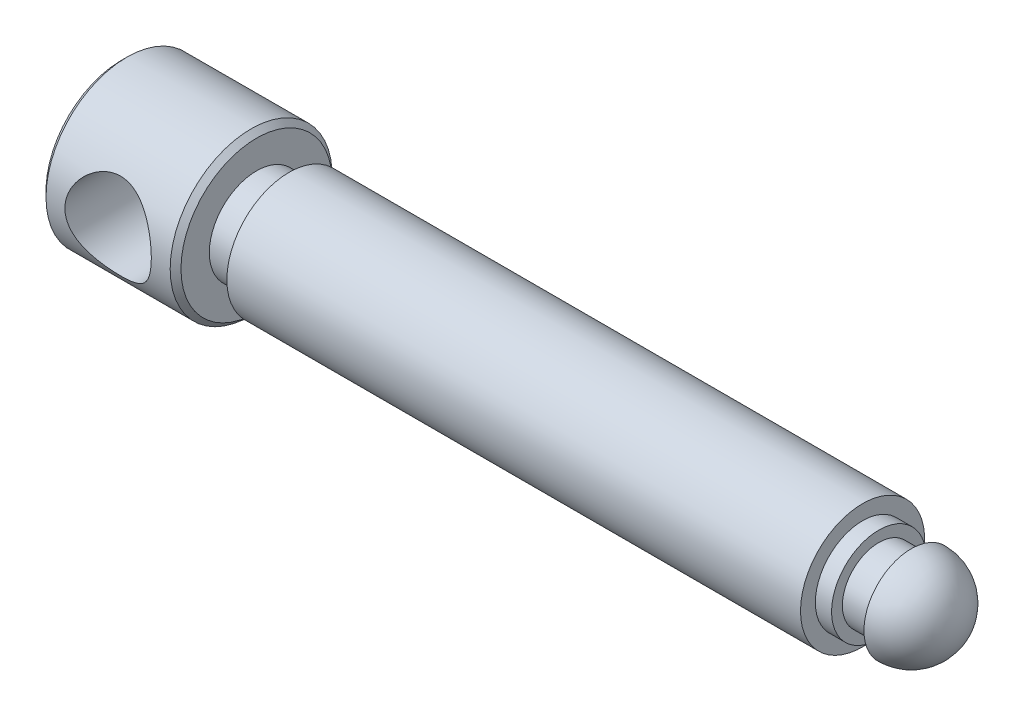
ISO-10303-21;
HEADER;
FILE_DESCRIPTION(('STEP AP214'),'2;1');
FILE_NAME('part.step','',(''),(''),'','','');
FILE_SCHEMA(('AUTOMOTIVE_DESIGN { 1 0 10303 214 1 1 1 1 }'));
ENDSEC;
DATA;
#1=APPLICATION_CONTEXT('core data for automotive mechanical design processes');
#2=APPLICATION_PROTOCOL_DEFINITION('international standard','automotive_design',2000,#1);
#3=PRODUCT_CONTEXT('',#1,'mechanical');
#4=PRODUCT('Part','Part','',(#3));
#5=PRODUCT_RELATED_PRODUCT_CATEGORY('part','',(#4));
#6=PRODUCT_DEFINITION_FORMATION('','',#4);
#7=PRODUCT_DEFINITION_CONTEXT('part definition',#1,'design');
#8=PRODUCT_DEFINITION('design','',#6,#7);
#9=PRODUCT_DEFINITION_SHAPE('','',#8);
#10=(LENGTH_UNIT() NAMED_UNIT(*) SI_UNIT(.MILLI.,.METRE.));
#11=(NAMED_UNIT(*) PLANE_ANGLE_UNIT() SI_UNIT($,.RADIAN.));
#12=(NAMED_UNIT(*) SI_UNIT($,.STERADIAN.) SOLID_ANGLE_UNIT());
#13=UNCERTAINTY_MEASURE_WITH_UNIT(LENGTH_MEASURE(1.E-05),#10,'distance_accuracy_value','');
#14=(GEOMETRIC_REPRESENTATION_CONTEXT(3) GLOBAL_UNCERTAINTY_ASSIGNED_CONTEXT((#13)) GLOBAL_UNIT_ASSIGNED_CONTEXT((#10,
#11,#12)) REPRESENTATION_CONTEXT('',''));
#15=CARTESIAN_POINT('',(0.,0.,0.));
#16=DIRECTION('',(0.,0.,1.));
#17=DIRECTION('',(1.,0.,0.));
#18=AXIS2_PLACEMENT_3D('',#15,#16,#17);
#19=CARTESIAN_POINT('',(-263.540634281476,0.,0.));
#20=DIRECTION('',(1.,0.,0.));
#21=DIRECTION('',(0.,0.,-1.));
#22=AXIS2_PLACEMENT_3D('',#19,#20,#21);
#23=PLANE('',#22);
#24=CARTESIAN_POINT('',(-263.540634281476,0.,0.));
#25=DIRECTION('',(1.,0.,0.));
#26=DIRECTION('',(0.,0.,-1.));
#27=AXIS2_PLACEMENT_3D('',#24,#25,#26);
#28=CIRCLE('',#27,28.);
#29=CARTESIAN_POINT('',(-263.540634281476,0.,-28.));
#30=VERTEX_POINT('',#29);
#31=EDGE_CURVE('E54',#30,#30,#28,.F.);
#32=ORIENTED_EDGE('',*,*,#31,.T.);
#33=EDGE_LOOP('',(#32));
#34=FACE_BOUND('',#33,.T.);
#35=ADVANCED_FACE('F37',(#34),#23,.F.);
#36=CARTESIAN_POINT('',(-145.227257266543,0.,0.));
#37=DIRECTION('',(-1.,0.,0.));
#38=DIRECTION('',(0.,0.,1.));
#39=AXIS2_PLACEMENT_3D('',#36,#37,#38);
#40=CYLINDRICAL_SURFACE('',#39,30.);
#41=CARTESIAN_POINT('',(-222.540634281476,0.,-30.));
#42=CARTESIAN_POINT('',(-222.540632407308,0.417316614472259,-30.0000015964104));
#43=CARTESIAN_POINT('',(-222.556977548486,0.834610148682561,-29.9912742029894));
#44=CARTESIAN_POINT('',(-222.622150813342,1.66607987515917,-29.9565910584832));
#45=CARTESIAN_POINT('',(-222.6709901004,2.08025494660496,-29.9306293865602));
#46=CARTESIAN_POINT('',(-222.800631840686,2.9027402183992,-29.8620939129719));
#47=CARTESIAN_POINT('',(-222.881477704122,3.3110416697354,-29.8194975509083));
#48=CARTESIAN_POINT('',(-223.074149901574,4.11825674931517,-29.7187718646467));
#49=CARTESIAN_POINT('',(-223.185973897224,4.51717108367463,-29.660643712868));
#50=CARTESIAN_POINT('',(-223.43884906271,5.3014298315636,-29.5305302787744));
#51=CARTESIAN_POINT('',(-223.579778884399,5.68682305192541,-29.4586026152064));
#52=CARTESIAN_POINT('',(-223.889755646519,6.44351938415923,-29.3023945885895));
#53=CARTESIAN_POINT('',(-224.058803018993,6.8148222794172,-29.2181140357334));
#54=CARTESIAN_POINT('',(-224.423525348936,7.54138264115369,-29.0390690434005));
#55=CARTESIAN_POINT('',(-224.619196527603,7.89664237517612,-28.9443060920806));
#56=CARTESIAN_POINT('',(-225.035738294361,8.58960090622609,-28.746280509847));
#57=CARTESIAN_POINT('',(-225.256611355537,8.92729797507082,-28.6430170450474));
#58=CARTESIAN_POINT('',(-225.737522120527,9.60543224291422,-28.423071212536));
#59=CARTESIAN_POINT('',(-225.999183061435,9.94457721535956,-28.305953023599));
#60=CARTESIAN_POINT('',(-226.547932018293,10.5998943734504,-28.0671317521904));
#61=CARTESIAN_POINT('',(-226.835020953047,10.9160657282261,-27.9454285041359));
#62=CARTESIAN_POINT('',(-227.433320139932,11.5243072708162,-27.7001432867818));
#63=CARTESIAN_POINT('',(-227.744544663306,11.8163629852009,-27.5765602412202));
#64=CARTESIAN_POINT('',(-228.389714093601,12.3750152359424,-27.3304267440353));
#65=CARTESIAN_POINT('',(-228.723669716179,12.6415996205324,-27.2078768104541));
#66=CARTESIAN_POINT('',(-229.444357042395,13.171009894089,-26.9558550244244));
#67=CARTESIAN_POINT('',(-229.833122256773,13.4312628695225,-26.8267749794922));
#68=CARTESIAN_POINT('',(-230.633896218372,13.9177168935999,-26.5776565398659));
#69=CARTESIAN_POINT('',(-231.045893382439,14.1439347089323,-26.4576137078421));
#70=CARTESIAN_POINT('',(-231.891059238664,14.5603912119796,-26.2307310508586));
#71=CARTESIAN_POINT('',(-232.324221595477,14.7506405840518,-26.1238873084132));
#72=CARTESIAN_POINT('',(-233.209156397593,15.0930559598869,-25.9275658565911));
#73=CARTESIAN_POINT('',(-233.660926503072,15.245226734909,-25.8380859718337));
#74=CARTESIAN_POINT('',(-234.551048904111,15.5010987219857,-25.6853413157061));
#75=CARTESIAN_POINT('',(-234.988479645255,15.6072317408332,-25.6207892250449));
#76=CARTESIAN_POINT('',(-235.873314591115,15.7825458803545,-25.5131707323053));
#77=CARTESIAN_POINT('',(-236.320718309142,15.8517288001216,-25.4701032841502));
#78=CARTESIAN_POINT('',(-237.2209389403,15.9519054575439,-25.4074836078511));
#79=CARTESIAN_POINT('',(-237.673749466333,15.9829404720556,-25.3879059637812));
#80=CARTESIAN_POINT('',(-238.580743140351,16.0063771438961,-25.3731377476935));
#81=CARTESIAN_POINT('',(-239.034926115328,15.9987834829966,-25.3779442203355));
#82=CARTESIAN_POINT('',(-239.876231493856,15.9489168297379,-25.409303184756));
#83=CARTESIAN_POINT('',(-240.263784443201,15.9116818051532,-25.4326956792603));
#84=CARTESIAN_POINT('',(-241.0337352917,15.8093400267818,-25.496439144946));
#85=CARTESIAN_POINT('',(-241.416133761103,15.7442363826838,-25.5367882240369));
#86=CARTESIAN_POINT('',(-242.173415952334,15.5869346216326,-25.6331025661497));
#87=CARTESIAN_POINT('',(-242.548297162907,15.4947276063112,-25.6890729575343));
#88=CARTESIAN_POINT('',(-243.288279282299,15.2842357272642,-25.8148629708695));
#89=CARTESIAN_POINT('',(-243.653379608973,15.1659493151776,-25.8846834150873));
#90=CARTESIAN_POINT('',(-244.379944792666,14.9015172447014,-26.0378306329587));
#91=CARTESIAN_POINT('',(-244.741149562577,14.7548120415171,-26.1214225448804));
#92=CARTESIAN_POINT('',(-245.44997115508,14.4364842043528,-26.2986902314838));
#93=CARTESIAN_POINT('',(-245.797583107756,14.264852741967,-26.3923695758895));
#94=CARTESIAN_POINT('',(-246.477849846134,13.8978418818407,-26.587462734169));
#95=CARTESIAN_POINT('',(-246.810501556252,13.7024576312097,-26.6888781269991));
#96=CARTESIAN_POINT('',(-247.459625026574,13.2890810424474,-26.8970980237653));
#97=CARTESIAN_POINT('',(-247.776097479282,13.071089673158,-27.0039022966568));
#98=CARTESIAN_POINT('',(-248.437192058713,12.5798158635565,-27.2366030909183));
#99=CARTESIAN_POINT('',(-248.779106729138,12.3031171358862,-27.3629969480447));
#100=CARTESIAN_POINT('',(-249.438854533292,11.7227069234556,-27.6166336279447));
#101=CARTESIAN_POINT('',(-249.7566863218,11.4189939317892,-27.7438764977111));
#102=CARTESIAN_POINT('',(-250.366978660086,10.7856895239167,-27.9961632643647));
#103=CARTESIAN_POINT('',(-250.659418594196,10.4560774862653,-28.1212053099356));
#104=CARTESIAN_POINT('',(-251.216876310016,9.77277984098681,-28.3659023453004));
#105=CARTESIAN_POINT('',(-251.481904829393,9.41910375048598,-28.4855594340477));
#106=CARTESIAN_POINT('',(-251.997929905785,8.66725586945523,-28.7235667308329));
#107=CARTESIAN_POINT('',(-252.247132772679,8.26768767624999,-28.8414085568862));
#108=CARTESIAN_POINT('',(-252.71063280943,7.44539330550649,-29.0645417941629));
#109=CARTESIAN_POINT('',(-252.924927961526,7.02266579118183,-29.1698324798017));
#110=CARTESIAN_POINT('',(-253.31613094595,6.15711520899938,-29.3647160614917));
#111=CARTESIAN_POINT('',(-253.493065369328,5.7143067080812,-29.4543201144987));
#112=CARTESIAN_POINT('',(-253.807465745088,4.81166929740086,-29.6151629470805));
#113=CARTESIAN_POINT('',(-253.944936944501,4.35184265955753,-29.6864041680495));
#114=CARTESIAN_POINT('',(-254.167935482018,3.46105834206432,-29.8027574749993));
#115=CARTESIAN_POINT('',(-254.25702118642,3.03122098835783,-29.8496426300395));
#116=CARTESIAN_POINT('',(-254.399691630961,2.16409614740306,-29.9250065104326));
#117=CARTESIAN_POINT('',(-254.453278445105,1.72680909693098,-29.9534863111066));
#118=CARTESIAN_POINT('',(-254.524178021524,0.848690324041078,-29.991211559869));
#119=CARTESIAN_POINT('',(-254.541508371249,0.407860424432522,-30.0004663337061));
#120=CARTESIAN_POINT('',(-254.539692477896,-0.473691137285343,-29.9994975522994));
#121=CARTESIAN_POINT('',(-254.520548319013,-0.91441280414001,-29.9892751100063));
#122=CARTESIAN_POINT('',(-254.449461530923,-1.75200203163494,-29.951460670903));
#123=CARTESIAN_POINT('',(-254.400656547878,-2.14921624877438,-29.9255310154378));
#124=CARTESIAN_POINT('',(-254.2737183712,-2.93759323982026,-29.8584498592921));
#125=CARTESIAN_POINT('',(-254.195587387527,-3.32875646740705,-29.8172995056216));
#126=CARTESIAN_POINT('',(-254.010854015392,-4.10250289434804,-29.7207251873776));
#127=CARTESIAN_POINT('',(-253.904250171651,-4.48508565406151,-29.6653004932323));
#128=CARTESIAN_POINT('',(-253.663654942026,-5.23936763780166,-29.5414137221054));
#129=CARTESIAN_POINT('',(-253.529662369604,-5.61106638951225,-29.4729510803011));
#130=CARTESIAN_POINT('',(-253.231862447277,-6.35064272241532,-29.3226065865993));
#131=CARTESIAN_POINT('',(-253.067396680553,-6.71819556186356,-29.2404334307729));
#132=CARTESIAN_POINT('',(-252.712394760614,-7.43789092448322,-29.0657001693169));
#133=CARTESIAN_POINT('',(-252.521858469725,-7.79003336626191,-28.9731400088357));
#134=CARTESIAN_POINT('',(-252.116067543188,-8.47743817078014,-28.7795168118367));
#135=CARTESIAN_POINT('',(-251.900806425643,-8.81269607375483,-28.6784515474727));
#136=CARTESIAN_POINT('',(-251.446953406757,-9.46492511713272,-28.4698516960132));
#137=CARTESIAN_POINT('',(-251.208359242362,-9.78189447899445,-28.3623164817923));
#138=CARTESIAN_POINT('',(-250.682232508819,-10.4294711192928,-28.1310630514942));
#139=CARTESIAN_POINT('',(-250.392196789169,-10.7578707424233,-28.0068492377319));
#140=CARTESIAN_POINT('',(-249.786697363662,-11.3893568970266,-27.7560444092996));
#141=CARTESIAN_POINT('',(-249.471232006307,-11.6924417818576,-27.6294532406453));
#142=CARTESIAN_POINT('',(-248.816174325944,-12.2721095592631,-27.3769125642621));
#143=CARTESIAN_POINT('',(-248.476566258831,-12.5486748764623,-27.2509635337311));
#144=CARTESIAN_POINT('',(-247.774714579172,-13.0737884989859,-27.0029706149779));
#145=CARTESIAN_POINT('',(-247.412460098196,-13.3223231889479,-26.8809286449739));
#146=CARTESIAN_POINT('',(-246.641752324519,-13.8055233478575,-26.6361738282389));
#147=CARTESIAN_POINT('',(-246.231831401378,-14.03811562989,-26.5139732939708));
#148=CARTESIAN_POINT('',(-245.390410383103,-14.4673241644843,-26.2822377643605));
#149=CARTESIAN_POINT('',(-244.958922499106,-14.6639604878487,-26.1726957156323));
#150=CARTESIAN_POINT('',(-244.077099911036,-15.0190963069182,-25.9705314522723));
#151=CARTESIAN_POINT('',(-243.626781782186,-15.1776285471485,-25.8778947267506));
#152=CARTESIAN_POINT('',(-242.710268440327,-15.4545523401524,-25.7134756185975));
#153=CARTESIAN_POINT('',(-242.244076070627,-15.5729510402437,-25.6416895230373));
#154=CARTESIAN_POINT('',(-241.346163910057,-15.758111994413,-25.5282686237118));
#155=CARTESIAN_POINT('',(-240.915537341097,-15.8287946290728,-25.4843700617585));
#156=CARTESIAN_POINT('',(-240.048295926515,-15.9347960263176,-25.418226224813));
#157=CARTESIAN_POINT('',(-239.611681515659,-15.9701173427815,-25.3959793860848));
#158=CARTESIAN_POINT('',(-238.736714039164,-16.0047851470654,-25.3741457936061));
#159=CARTESIAN_POINT('',(-238.298362129451,-16.004152498475,-25.3745458981463));
#160=CARTESIAN_POINT('',(-237.423812525541,-15.9669729705107,-25.3979578454701));
#161=CARTESIAN_POINT('',(-236.987614691293,-15.9304284577576,-25.4209681982201));
#162=CARTESIAN_POINT('',(-236.174235279442,-15.8286799928478,-25.4844255727231));
#163=CARTESIAN_POINT('',(-235.796344538023,-15.7675151928877,-25.5224035880461));
#164=CARTESIAN_POINT('',(-235.047581306079,-15.6187167538708,-25.6137327955021));
#165=CARTESIAN_POINT('',(-234.676711127335,-15.5310745518873,-25.6670889607501));
#166=CARTESIAN_POINT('',(-233.944234339837,-15.3302755987347,-25.7875227557159));
#167=CARTESIAN_POINT('',(-233.582628183235,-15.217117604838,-25.8546010537453));
#168=CARTESIAN_POINT('',(-232.870438254438,-14.9663434225213,-26.0005691844178));
#169=CARTESIAN_POINT('',(-232.519855680546,-14.8287245858638,-26.0794602958217));
#170=CARTESIAN_POINT('',(-231.809052498569,-14.5205154051164,-26.2523869051774));
#171=CARTESIAN_POINT('',(-231.449662834343,-14.348373464664,-26.3470701802545));
#172=CARTESIAN_POINT('',(-230.746536879375,-13.9789053554925,-26.5449450455436));
#173=CARTESIAN_POINT('',(-230.402801018595,-13.7815784955859,-26.648136869241));
#174=CARTESIAN_POINT('',(-229.732091378758,-13.3628561989552,-26.8605508844621));
#175=CARTESIAN_POINT('',(-229.405124044394,-13.1414516088866,-26.969775361528));
#176=CARTESIAN_POINT('',(-228.76916703864,-12.6757171472423,-27.1917773989296));
#177=CARTESIAN_POINT('',(-228.460180144161,-12.4313837496701,-27.3045555039659));
#178=CARTESIAN_POINT('',(-227.817864334891,-11.8838196493821,-27.5477235134623));
#179=CARTESIAN_POINT('',(-227.487498120914,-11.5771851863521,-27.678296930114));
#180=CARTESIAN_POINT('',(-226.853531471412,-10.9368444745113,-27.9375143867975));
#181=CARTESIAN_POINT('',(-226.549923417846,-10.603145983113,-28.0661589672565));
#182=CARTESIAN_POINT('',(-225.970846671917,-9.90982344755265,-28.3183964109742));
#183=CARTESIAN_POINT('',(-225.695402681077,-9.55017710915481,-28.4419847836202));
#184=CARTESIAN_POINT('',(-225.174870931469,-8.806939867951,-28.6808325163881));
#185=CARTESIAN_POINT('',(-224.929781954196,-8.42334992721471,-28.7960922107606));
#186=CARTESIAN_POINT('',(-224.466397091658,-7.6245764267724,-29.0179558835919));
#187=CARTESIAN_POINT('',(-224.248899137671,-7.20885093464136,-29.1242806813509));
#188=CARTESIAN_POINT('',(-223.850112022309,-6.35686894393567,-29.3220301018713));
#189=CARTESIAN_POINT('',(-223.668827832903,-5.92060963631616,-29.4134526783152));
#190=CARTESIAN_POINT('',(-223.345104420634,-5.03180053719008,-29.5784511109658));
#191=CARTESIAN_POINT('',(-223.202575074189,-4.57929135987545,-29.6520683283007));
#192=CARTESIAN_POINT('',(-222.957861598381,-3.66098505143207,-29.7793866834819));
#193=CARTESIAN_POINT('',(-222.855655100564,-3.19519544162572,-29.8330988623224));
#194=CARTESIAN_POINT('',(-222.696847456767,-2.27631305233221,-29.9169059413642));
#195=CARTESIAN_POINT('',(-222.638345314786,-1.82363816388867,-29.9479835987123));
#196=CARTESIAN_POINT('',(-222.560239520859,-0.913966326438469,-29.9895298771136));
#197=CARTESIAN_POINT('',(-222.540636333724,-0.456969325851426,-29.9999982519014));
#198=CARTESIAN_POINT('',(-222.540634281476,0.,-30.));
#199=B_SPLINE_CURVE_WITH_KNOTS('',3,(#41,#42,#43,#44,#45,#46,#47,#48,#49,#50,#51,#52,#53,#54,
#55,#56,#57,#58,#59,#60,#61,#62,#63,#64,#65,#66,#67,#68,#69,#70,#71,#72,#73,#74,#75,#76,#77,#78,
#79,#80,#81,#82,#83,#84,#85,#86,#87,#88,#89,#90,#91,#92,#93,#94,#95,#96,#97,#98,#99,#100,#101,
#102,#103,#104,#105,#106,#107,#108,#109,#110,#111,#112,#113,#114,#115,#116,#117,#118,#119,#120,
#121,#122,#123,#124,#125,#126,#127,#128,#129,#130,#131,#132,#133,#134,#135,#136,#137,#138,#139,
#140,#141,#142,#143,#144,#145,#146,#147,#148,#149,#150,#151,#152,#153,#154,#155,#156,#157,#158,
#159,#160,#161,#162,#163,#164,#165,#166,#167,#168,#169,#170,#171,#172,#173,#174,#175,#176,#177,
#178,#179,#180,#181,#182,#183,#184,#185,#186,#187,#188,#189,#190,#191,#192,#193,#194,#195,#196,
#197,#198),.UNSPECIFIED.,.T.,.F.,(4,2,2,2,2,2,2,2,2,2,2,2,2,2,2,2,2,2,2,2,2,2,2,2,2,2,2,2,2,2,2,
2,2,2,2,2,2,2,2,2,2,2,2,2,2,2,2,2,2,2,2,2,2,2,2,2,2,2,2,2,2,2,2,2,2,2,2,2,2,2,2,2,2,2,2,2,2,2,
4),(0.,1.25150187782946,2.50343393190762,3.75706981851596,5.01061110096058,6.25902796134372,
7.50746400617964,8.7557230409551,10.004104674092,11.3349411410633,12.6658257154791,
13.9975033244764,15.3298131058322,16.7839556799366,18.2373795398114,19.6903709822227,
21.1431802731224,22.5053430097978,23.8674394169767,25.2280607053937,26.5885170912798,
27.7572521224294,28.9258567755775,30.094845525274,31.263903697743,32.4588821711482,
33.6542849200147,34.8499323112692,36.0455284834785,37.4170026073558,38.7885532826519,
40.1612073068289,41.5333215787083,42.9876929274949,44.4421483131333,45.8955649921014,
47.3487883351373,48.6713852181947,49.9939048223742,51.3157827437961,52.6375851338415,
53.839305618689,55.0409355620551,56.2426269337882,57.4443703763717,58.6759907953019,
59.9076177184675,61.1395682669817,62.3716384201643,63.7363989066236,65.1012480973163,
66.4669956550514,67.8334037682407,69.2921777219667,70.7501348779867,72.2068346311873,
73.6632748266079,74.9771318710811,76.2908940188118,77.6038938162903,78.9168070918292,
80.0695878532,81.2227418295687,82.3759519815833,83.5292870612871,84.7568202704322,
85.9843871758557,87.2124223930198,88.4406467681128,89.8468854467984,91.2527224676303,
92.6597820996966,94.0667852315305,95.5080561813663,96.9495248747297,98.3876122229595,
99.8249006898231,101.195301761714,102.565719208757),.UNSPECIFIED.);
#200=CARTESIAN_POINT('',(-222.540634281476,0.,-30.));
#201=VERTEX_POINT('',#200);
#202=EDGE_CURVE('E10',#201,#201,#199,.T.);
#203=ORIENTED_EDGE('',*,*,#202,.T.);
#204=EDGE_LOOP('',(#203));
#205=FACE_BOUND('',#204,.T.);
#206=CARTESIAN_POINT('',(-222.540634281476,0.,30.));
#207=CARTESIAN_POINT('',(-222.540632407308,-0.417316614472259,30.0000015964104));
#208=CARTESIAN_POINT('',(-222.556977548486,-0.834610148682561,29.9912742029894));
#209=CARTESIAN_POINT('',(-222.622150813342,-1.66607987515917,29.9565910584832));
#210=CARTESIAN_POINT('',(-222.6709901004,-2.08025494660496,29.9306293865602));
#211=CARTESIAN_POINT('',(-222.800631840686,-2.9027402183992,29.8620939129719));
#212=CARTESIAN_POINT('',(-222.881477704122,-3.3110416697354,29.8194975509083));
#213=CARTESIAN_POINT('',(-223.074149901574,-4.11825674931517,29.7187718646467));
#214=CARTESIAN_POINT('',(-223.185973897224,-4.51717108367463,29.660643712868));
#215=CARTESIAN_POINT('',(-223.43884906271,-5.3014298315636,29.5305302787744));
#216=CARTESIAN_POINT('',(-223.579778884399,-5.68682305192541,29.4586026152064));
#217=CARTESIAN_POINT('',(-223.889755646519,-6.44351938415923,29.3023945885895));
#218=CARTESIAN_POINT('',(-224.058803018993,-6.8148222794172,29.2181140357334));
#219=CARTESIAN_POINT('',(-224.423525348936,-7.54138264115369,29.0390690434005));
#220=CARTESIAN_POINT('',(-224.619196527603,-7.89664237517612,28.9443060920806));
#221=CARTESIAN_POINT('',(-225.035738294361,-8.58960090622609,28.746280509847));
#222=CARTESIAN_POINT('',(-225.256611355537,-8.92729797507082,28.6430170450474));
#223=CARTESIAN_POINT('',(-225.737522120527,-9.60543224291422,28.423071212536));
#224=CARTESIAN_POINT('',(-225.999183061435,-9.94457721535956,28.305953023599));
#225=CARTESIAN_POINT('',(-226.547932018293,-10.5998943734504,28.0671317521904));
#226=CARTESIAN_POINT('',(-226.835020953047,-10.9160657282261,27.9454285041359));
#227=CARTESIAN_POINT('',(-227.433320139932,-11.5243072708162,27.7001432867818));
#228=CARTESIAN_POINT('',(-227.744544663306,-11.8163629852009,27.5765602412202));
#229=CARTESIAN_POINT('',(-228.389714093601,-12.3750152359424,27.3304267440353));
#230=CARTESIAN_POINT('',(-228.723669716179,-12.6415996205324,27.2078768104541));
#231=CARTESIAN_POINT('',(-229.444357042395,-13.171009894089,26.9558550244244));
#232=CARTESIAN_POINT('',(-229.833122256773,-13.4312628695225,26.8267749794922));
#233=CARTESIAN_POINT('',(-230.633896218372,-13.9177168935999,26.5776565398659));
#234=CARTESIAN_POINT('',(-231.045893382439,-14.1439347089323,26.4576137078421));
#235=CARTESIAN_POINT('',(-231.891059238664,-14.5603912119796,26.2307310508586));
#236=CARTESIAN_POINT('',(-232.324221595477,-14.7506405840518,26.1238873084132));
#237=CARTESIAN_POINT('',(-233.209156397593,-15.0930559598869,25.9275658565911));
#238=CARTESIAN_POINT('',(-233.660926503072,-15.245226734909,25.8380859718337));
#239=CARTESIAN_POINT('',(-234.551048904111,-15.5010987219857,25.6853413157061));
#240=CARTESIAN_POINT('',(-234.988479645255,-15.6072317408332,25.6207892250449));
#241=CARTESIAN_POINT('',(-235.873314591115,-15.7825458803545,25.5131707323053));
#242=CARTESIAN_POINT('',(-236.320718309142,-15.8517288001216,25.4701032841502));
#243=CARTESIAN_POINT('',(-237.2209389403,-15.9519054575439,25.4074836078511));
#244=CARTESIAN_POINT('',(-237.673749466333,-15.9829404720556,25.3879059637812));
#245=CARTESIAN_POINT('',(-238.580743140351,-16.0063771438961,25.3731377476935));
#246=CARTESIAN_POINT('',(-239.034926115328,-15.9987834829966,25.3779442203355));
#247=CARTESIAN_POINT('',(-239.876231493856,-15.9489168297379,25.409303184756));
#248=CARTESIAN_POINT('',(-240.263784443201,-15.9116818051532,25.4326956792603));
#249=CARTESIAN_POINT('',(-241.0337352917,-15.8093400267818,25.496439144946));
#250=CARTESIAN_POINT('',(-241.416133761103,-15.7442363826838,25.5367882240369));
#251=CARTESIAN_POINT('',(-242.173415952334,-15.5869346216326,25.6331025661497));
#252=CARTESIAN_POINT('',(-242.548297162907,-15.4947276063112,25.6890729575343));
#253=CARTESIAN_POINT('',(-243.288279282299,-15.2842357272642,25.8148629708695));
#254=CARTESIAN_POINT('',(-243.653379608973,-15.1659493151776,25.8846834150873));
#255=CARTESIAN_POINT('',(-244.379944792666,-14.9015172447014,26.0378306329587));
#256=CARTESIAN_POINT('',(-244.741149562577,-14.7548120415171,26.1214225448804));
#257=CARTESIAN_POINT('',(-245.44997115508,-14.4364842043528,26.2986902314838));
#258=CARTESIAN_POINT('',(-245.797583107756,-14.264852741967,26.3923695758895));
#259=CARTESIAN_POINT('',(-246.477849846134,-13.8978418818407,26.587462734169));
#260=CARTESIAN_POINT('',(-246.810501556252,-13.7024576312097,26.6888781269991));
#261=CARTESIAN_POINT('',(-247.459625026574,-13.2890810424474,26.8970980237653));
#262=CARTESIAN_POINT('',(-247.776097479282,-13.071089673158,27.0039022966568));
#263=CARTESIAN_POINT('',(-248.437192058713,-12.5798158635565,27.2366030909183));
#264=CARTESIAN_POINT('',(-248.779106729138,-12.3031171358862,27.3629969480447));
#265=CARTESIAN_POINT('',(-249.438854533292,-11.7227069234556,27.6166336279447));
#266=CARTESIAN_POINT('',(-249.7566863218,-11.4189939317892,27.7438764977111));
#267=CARTESIAN_POINT('',(-250.366978660086,-10.7856895239167,27.9961632643647));
#268=CARTESIAN_POINT('',(-250.659418594196,-10.4560774862653,28.1212053099356));
#269=CARTESIAN_POINT('',(-251.216876310016,-9.77277984098681,28.3659023453004));
#270=CARTESIAN_POINT('',(-251.481904829393,-9.41910375048598,28.4855594340477));
#271=CARTESIAN_POINT('',(-251.997929905785,-8.66725586945523,28.7235667308329));
#272=CARTESIAN_POINT('',(-252.247132772679,-8.26768767624999,28.8414085568862));
#273=CARTESIAN_POINT('',(-252.71063280943,-7.44539330550649,29.0645417941629));
#274=CARTESIAN_POINT('',(-252.924927961526,-7.02266579118183,29.1698324798017));
#275=CARTESIAN_POINT('',(-253.31613094595,-6.15711520899938,29.3647160614917));
#276=CARTESIAN_POINT('',(-253.493065369328,-5.7143067080812,29.4543201144987));
#277=CARTESIAN_POINT('',(-253.807465745088,-4.81166929740086,29.6151629470805));
#278=CARTESIAN_POINT('',(-253.944936944501,-4.35184265955753,29.6864041680495));
#279=CARTESIAN_POINT('',(-254.167935482018,-3.46105834206432,29.8027574749993));
#280=CARTESIAN_POINT('',(-254.25702118642,-3.03122098835783,29.8496426300395));
#281=CARTESIAN_POINT('',(-254.399691630961,-2.16409614740306,29.9250065104326));
#282=CARTESIAN_POINT('',(-254.453278445105,-1.72680909693098,29.9534863111066));
#283=CARTESIAN_POINT('',(-254.524178021524,-0.848690324041078,29.991211559869));
#284=CARTESIAN_POINT('',(-254.541508371249,-0.407860424432522,30.0004663337061));
#285=CARTESIAN_POINT('',(-254.539692477896,0.473691137285343,29.9994975522994));
#286=CARTESIAN_POINT('',(-254.520548319013,0.91441280414001,29.9892751100063));
#287=CARTESIAN_POINT('',(-254.449461530923,1.75200203163494,29.951460670903));
#288=CARTESIAN_POINT('',(-254.400656547878,2.14921624877438,29.9255310154378));
#289=CARTESIAN_POINT('',(-254.2737183712,2.93759323982026,29.8584498592921));
#290=CARTESIAN_POINT('',(-254.195587387527,3.32875646740705,29.8172995056216));
#291=CARTESIAN_POINT('',(-254.010854015392,4.10250289434804,29.7207251873776));
#292=CARTESIAN_POINT('',(-253.904250171651,4.48508565406151,29.6653004932323));
#293=CARTESIAN_POINT('',(-253.663654942026,5.23936763780166,29.5414137221054));
#294=CARTESIAN_POINT('',(-253.529662369604,5.61106638951225,29.4729510803011));
#295=CARTESIAN_POINT('',(-253.231862447277,6.35064272241532,29.3226065865993));
#296=CARTESIAN_POINT('',(-253.067396680553,6.71819556186356,29.2404334307729));
#297=CARTESIAN_POINT('',(-252.712394760614,7.43789092448322,29.0657001693169));
#298=CARTESIAN_POINT('',(-252.521858469725,7.79003336626191,28.9731400088357));
#299=CARTESIAN_POINT('',(-252.116067543188,8.47743817078014,28.7795168118367));
#300=CARTESIAN_POINT('',(-251.900806425643,8.81269607375483,28.6784515474727));
#301=CARTESIAN_POINT('',(-251.446953406757,9.46492511713272,28.4698516960132));
#302=CARTESIAN_POINT('',(-251.208359242362,9.78189447899445,28.3623164817923));
#303=CARTESIAN_POINT('',(-250.682232508819,10.4294711192928,28.1310630514942));
#304=CARTESIAN_POINT('',(-250.392196789169,10.7578707424233,28.0068492377319));
#305=CARTESIAN_POINT('',(-249.786697363662,11.3893568970266,27.7560444092996));
#306=CARTESIAN_POINT('',(-249.471232006307,11.6924417818576,27.6294532406453));
#307=CARTESIAN_POINT('',(-248.816174325944,12.2721095592631,27.3769125642621));
#308=CARTESIAN_POINT('',(-248.476566258831,12.5486748764623,27.2509635337311));
#309=CARTESIAN_POINT('',(-247.774714579172,13.0737884989859,27.0029706149779));
#310=CARTESIAN_POINT('',(-247.412460098196,13.3223231889479,26.8809286449739));
#311=CARTESIAN_POINT('',(-246.641752324519,13.8055233478575,26.6361738282389));
#312=CARTESIAN_POINT('',(-246.231831401378,14.03811562989,26.5139732939708));
#313=CARTESIAN_POINT('',(-245.390410383103,14.4673241644843,26.2822377643605));
#314=CARTESIAN_POINT('',(-244.958922499106,14.6639604878487,26.1726957156323));
#315=CARTESIAN_POINT('',(-244.077099911036,15.0190963069182,25.9705314522723));
#316=CARTESIAN_POINT('',(-243.626781782186,15.1776285471485,25.8778947267506));
#317=CARTESIAN_POINT('',(-242.710268440327,15.4545523401524,25.7134756185975));
#318=CARTESIAN_POINT('',(-242.244076070627,15.5729510402437,25.6416895230373));
#319=CARTESIAN_POINT('',(-241.346163910057,15.758111994413,25.5282686237118));
#320=CARTESIAN_POINT('',(-240.915537341097,15.8287946290728,25.4843700617585));
#321=CARTESIAN_POINT('',(-240.048295926515,15.9347960263176,25.418226224813));
#322=CARTESIAN_POINT('',(-239.611681515659,15.9701173427815,25.3959793860848));
#323=CARTESIAN_POINT('',(-238.736714039164,16.0047851470654,25.3741457936061));
#324=CARTESIAN_POINT('',(-238.298362129451,16.004152498475,25.3745458981463));
#325=CARTESIAN_POINT('',(-237.423812525541,15.9669729705107,25.3979578454701));
#326=CARTESIAN_POINT('',(-236.987614691293,15.9304284577576,25.4209681982201));
#327=CARTESIAN_POINT('',(-236.174235279442,15.8286799928478,25.4844255727231));
#328=CARTESIAN_POINT('',(-235.796344538023,15.7675151928877,25.5224035880461));
#329=CARTESIAN_POINT('',(-235.047581306079,15.6187167538708,25.6137327955021));
#330=CARTESIAN_POINT('',(-234.676711127335,15.5310745518873,25.6670889607501));
#331=CARTESIAN_POINT('',(-233.944234339837,15.3302755987347,25.7875227557159));
#332=CARTESIAN_POINT('',(-233.582628183235,15.217117604838,25.8546010537453));
#333=CARTESIAN_POINT('',(-232.870438254438,14.9663434225213,26.0005691844178));
#334=CARTESIAN_POINT('',(-232.519855680546,14.8287245858638,26.0794602958217));
#335=CARTESIAN_POINT('',(-231.809052498569,14.5205154051164,26.2523869051774));
#336=CARTESIAN_POINT('',(-231.449662834343,14.348373464664,26.3470701802545));
#337=CARTESIAN_POINT('',(-230.746536879375,13.9789053554925,26.5449450455436));
#338=CARTESIAN_POINT('',(-230.402801018595,13.7815784955859,26.648136869241));
#339=CARTESIAN_POINT('',(-229.732091378758,13.3628561989552,26.8605508844621));
#340=CARTESIAN_POINT('',(-229.405124044394,13.1414516088866,26.969775361528));
#341=CARTESIAN_POINT('',(-228.76916703864,12.6757171472423,27.1917773989296));
#342=CARTESIAN_POINT('',(-228.460180144161,12.4313837496701,27.3045555039659));
#343=CARTESIAN_POINT('',(-227.817864334891,11.8838196493821,27.5477235134623));
#344=CARTESIAN_POINT('',(-227.487498120914,11.5771851863521,27.678296930114));
#345=CARTESIAN_POINT('',(-226.853531471412,10.9368444745113,27.9375143867975));
#346=CARTESIAN_POINT('',(-226.549923417846,10.603145983113,28.0661589672565));
#347=CARTESIAN_POINT('',(-225.970846671917,9.90982344755265,28.3183964109742));
#348=CARTESIAN_POINT('',(-225.695402681077,9.55017710915481,28.4419847836202));
#349=CARTESIAN_POINT('',(-225.174870931469,8.806939867951,28.6808325163881));
#350=CARTESIAN_POINT('',(-224.929781954196,8.42334992721471,28.7960922107606));
#351=CARTESIAN_POINT('',(-224.466397091658,7.6245764267724,29.0179558835919));
#352=CARTESIAN_POINT('',(-224.248899137671,7.20885093464136,29.1242806813509));
#353=CARTESIAN_POINT('',(-223.850112022309,6.35686894393567,29.3220301018713));
#354=CARTESIAN_POINT('',(-223.668827832903,5.92060963631616,29.4134526783152));
#355=CARTESIAN_POINT('',(-223.345104420634,5.03180053719008,29.5784511109658));
#356=CARTESIAN_POINT('',(-223.202575074189,4.57929135987545,29.6520683283007));
#357=CARTESIAN_POINT('',(-222.957861598381,3.66098505143207,29.7793866834819));
#358=CARTESIAN_POINT('',(-222.855655100564,3.19519544162572,29.8330988623224));
#359=CARTESIAN_POINT('',(-222.696847456767,2.27631305233221,29.9169059413642));
#360=CARTESIAN_POINT('',(-222.638345314786,1.82363816388867,29.9479835987123));
#361=CARTESIAN_POINT('',(-222.560239520859,0.913966326438469,29.9895298771136));
#362=CARTESIAN_POINT('',(-222.540636333724,0.456969325851426,29.9999982519014));
#363=CARTESIAN_POINT('',(-222.540634281476,0.,30.));
#364=B_SPLINE_CURVE_WITH_KNOTS('',3,(#206,#207,#208,#209,#210,#211,#212,#213,#214,#215,#216,
#217,#218,#219,#220,#221,#222,#223,#224,#225,#226,#227,#228,#229,#230,#231,#232,#233,#234,#235,
#236,#237,#238,#239,#240,#241,#242,#243,#244,#245,#246,#247,#248,#249,#250,#251,#252,#253,#254,
#255,#256,#257,#258,#259,#260,#261,#262,#263,#264,#265,#266,#267,#268,#269,#270,#271,#272,#273,
#274,#275,#276,#277,#278,#279,#280,#281,#282,#283,#284,#285,#286,#287,#288,#289,#290,#291,#292,
#293,#294,#295,#296,#297,#298,#299,#300,#301,#302,#303,#304,#305,#306,#307,#308,#309,#310,#311,
#312,#313,#314,#315,#316,#317,#318,#319,#320,#321,#322,#323,#324,#325,#326,#327,#328,#329,#330,
#331,#332,#333,#334,#335,#336,#337,#338,#339,#340,#341,#342,#343,#344,#345,#346,#347,#348,#349,
#350,#351,#352,#353,#354,#355,#356,#357,#358,#359,#360,#361,#362,#363),.UNSPECIFIED.,.T.,.F.,(4,
2,2,2,2,2,2,2,2,2,2,2,2,2,2,2,2,2,2,2,2,2,2,2,2,2,2,2,2,2,2,2,2,2,2,2,2,2,2,2,2,2,2,2,2,2,2,2,2,
2,2,2,2,2,2,2,2,2,2,2,2,2,2,2,2,2,2,2,2,2,2,2,2,2,2,2,2,2,4),(0.,1.25150187782946,
2.50343393190762,3.75706981851596,5.01061110096058,6.25902796134372,7.50746400617964,
8.7557230409551,10.004104674092,11.3349411410633,12.6658257154791,13.9975033244764,
15.3298131058322,16.7839556799366,18.2373795398114,19.6903709822227,21.1431802731224,
22.5053430097978,23.8674394169767,25.2280607053937,26.5885170912798,27.7572521224294,
28.9258567755775,30.094845525274,31.263903697743,32.4588821711482,33.6542849200147,
34.8499323112692,36.0455284834785,37.4170026073558,38.7885532826519,40.1612073068289,
41.5333215787083,42.9876929274949,44.4421483131333,45.8955649921014,47.3487883351373,
48.6713852181947,49.9939048223742,51.3157827437961,52.6375851338415,53.839305618689,
55.0409355620551,56.2426269337882,57.4443703763717,58.6759907953019,59.9076177184675,
61.1395682669817,62.3716384201643,63.7363989066236,65.1012480973163,66.4669956550514,
67.8334037682407,69.2921777219667,70.7501348779867,72.2068346311873,73.6632748266079,
74.9771318710811,76.2908940188118,77.6038938162903,78.9168070918292,80.0695878532,
81.2227418295687,82.3759519815833,83.5292870612871,84.7568202704322,85.9843871758557,
87.2124223930198,88.4406467681128,89.8468854467984,91.2527224676303,92.6597820996966,
94.0667852315305,95.5080561813663,96.9495248747297,98.3876122229595,99.8249006898231,
101.195301761714,102.565719208757),.UNSPECIFIED.);
#365=CARTESIAN_POINT('',(-222.540634281476,0.,30.));
#366=VERTEX_POINT('',#365);
#367=EDGE_CURVE('E50',#366,#366,#364,.T.);
#368=ORIENTED_EDGE('',*,*,#367,.T.);
#369=EDGE_LOOP('',(#368));
#370=FACE_BOUND('',#369,.T.);
#371=CARTESIAN_POINT('',(-215.540634281476,0.,0.));
#372=DIRECTION('',(-1.,0.,0.));
#373=DIRECTION('',(0.,0.,1.));
#374=AXIS2_PLACEMENT_3D('',#371,#372,#373);
#375=CIRCLE('',#374,30.);
#376=CARTESIAN_POINT('',(-215.540634281476,0.,30.));
#377=VERTEX_POINT('',#376);
#378=EDGE_CURVE('E135',#377,#377,#375,.T.);
#379=ORIENTED_EDGE('',*,*,#378,.T.);
#380=EDGE_LOOP('',(#379));
#381=FACE_BOUND('',#380,.T.);
#382=CARTESIAN_POINT('',(-261.540634281476,0.,0.));
#383=DIRECTION('',(1.,0.,0.));
#384=DIRECTION('',(0.,0.,-1.));
#385=AXIS2_PLACEMENT_3D('',#382,#383,#384);
#386=CIRCLE('',#385,30.);
#387=CARTESIAN_POINT('',(-261.540634281476,0.,-30.));
#388=VERTEX_POINT('',#387);
#389=EDGE_CURVE('E137',#388,#388,#386,.T.);
#390=ORIENTED_EDGE('',*,*,#389,.T.);
#391=EDGE_LOOP('',(#390));
#392=FACE_BOUND('',#391,.T.);
#393=ADVANCED_FACE('F64',(#205,#370,#381,#392),#40,.T.);
#394=CARTESIAN_POINT('',(-213.540634281476,30.,0.));
#395=DIRECTION('',(-1.,0.,0.));
#396=DIRECTION('',(0.,0.,1.));
#397=AXIS2_PLACEMENT_3D('',#394,#395,#396);
#398=PLANE('',#397);
#399=CARTESIAN_POINT('',(-213.540634281476,0.,0.));
#400=DIRECTION('',(-1.,0.,0.));
#401=DIRECTION('',(0.,0.,1.));
#402=AXIS2_PLACEMENT_3D('',#399,#400,#401);
#403=CIRCLE('',#402,27.9999999999999);
#404=CARTESIAN_POINT('',(-213.540634281476,0.,27.9999999999999));
#405=VERTEX_POINT('',#404);
#406=EDGE_CURVE('E58',#405,#405,#403,.F.);
#407=ORIENTED_EDGE('',*,*,#406,.T.);
#408=EDGE_LOOP('',(#407));
#409=FACE_BOUND('',#408,.T.);
#410=CARTESIAN_POINT('',(-213.540634281476,0.,0.));
#411=DIRECTION('',(-1.,0.,0.));
#412=DIRECTION('',(0.,0.,1.));
#413=AXIS2_PLACEMENT_3D('',#410,#411,#412);
#414=CIRCLE('',#413,17.5);
#415=CARTESIAN_POINT('',(-213.540634281476,0.,17.5));
#416=VERTEX_POINT('',#415);
#417=EDGE_CURVE('E140',#416,#416,#414,.T.);
#418=ORIENTED_EDGE('',*,*,#417,.T.);
#419=EDGE_LOOP('',(#418));
#420=FACE_BOUND('',#419,.T.);
#421=ADVANCED_FACE('F109',(#409,#420),#398,.F.);
#422=CARTESIAN_POINT('',(-145.227257266543,0.,0.));
#423=DIRECTION('',(-1.,0.,0.));
#424=DIRECTION('',(0.,0.,1.));
#425=AXIS2_PLACEMENT_3D('',#422,#423,#424);
#426=CYLINDRICAL_SURFACE('',#425,17.5);
#427=ORIENTED_EDGE('',*,*,#417,.F.);
#428=EDGE_LOOP('',(#427));
#429=FACE_BOUND('',#428,.T.);
#430=CARTESIAN_POINT('',(-201.540634281476,0.,0.));
#431=DIRECTION('',(-1.,0.,0.));
#432=DIRECTION('',(0.,0.,1.));
#433=AXIS2_PLACEMENT_3D('',#430,#431,#432);
#434=CIRCLE('',#433,17.5);
#435=CARTESIAN_POINT('',(-201.540634281476,0.,17.5));
#436=VERTEX_POINT('',#435);
#437=EDGE_CURVE('E145',#436,#436,#434,.T.);
#438=ORIENTED_EDGE('',*,*,#437,.T.);
#439=EDGE_LOOP('',(#438));
#440=FACE_BOUND('',#439,.T.);
#441=ADVANCED_FACE('F106',(#429,#440),#426,.T.);
#442=CARTESIAN_POINT('',(-201.540634281476,17.5,0.));
#443=DIRECTION('',(1.,0.,0.));
#444=DIRECTION('',(0.,0.,-1.));
#445=AXIS2_PLACEMENT_3D('',#442,#443,#444);
#446=PLANE('',#445);
#447=ORIENTED_EDGE('',*,*,#437,.F.);
#448=EDGE_LOOP('',(#447));
#449=FACE_BOUND('',#448,.T.);
#450=CARTESIAN_POINT('',(-201.540634281476,0.,0.));
#451=DIRECTION('',(-1.,0.,0.));
#452=DIRECTION('',(0.,0.,1.));
#453=AXIS2_PLACEMENT_3D('',#450,#451,#452);
#454=CIRCLE('',#453,23.);
#455=CARTESIAN_POINT('',(-201.540634281476,0.,23.));
#456=VERTEX_POINT('',#455);
#457=EDGE_CURVE('E148',#456,#456,#454,.T.);
#458=ORIENTED_EDGE('',*,*,#457,.T.);
#459=EDGE_LOOP('',(#458));
#460=FACE_BOUND('',#459,.T.);
#461=ADVANCED_FACE('F102',(#449,#460),#446,.F.);
#462=CARTESIAN_POINT('',(-145.227257266543,0.,0.));
#463=DIRECTION('',(-1.,0.,0.));
#464=DIRECTION('',(0.,0.,1.));
#465=AXIS2_PLACEMENT_3D('',#462,#463,#464);
#466=CYLINDRICAL_SURFACE('',#465,23.);
#467=ORIENTED_EDGE('',*,*,#457,.F.);
#468=EDGE_LOOP('',(#467));
#469=FACE_BOUND('',#468,.T.);
#470=CARTESIAN_POINT('',(10.9593657185238,0.,0.));
#471=DIRECTION('',(-1.,0.,0.));
#472=DIRECTION('',(0.,0.,1.));
#473=AXIS2_PLACEMENT_3D('',#470,#471,#472);
#474=CIRCLE('',#473,23.);
#475=CARTESIAN_POINT('',(10.9593657185238,0.,23.));
#476=VERTEX_POINT('',#475);
#477=EDGE_CURVE('E151',#476,#476,#474,.T.);
#478=ORIENTED_EDGE('',*,*,#477,.T.);
#479=EDGE_LOOP('',(#478));
#480=FACE_BOUND('',#479,.T.);
#481=ADVANCED_FACE('F98',(#469,#480),#466,.T.);
#482=CARTESIAN_POINT('',(10.9593657185238,23.,0.));
#483=DIRECTION('',(-1.,0.,0.));
#484=DIRECTION('',(0.,0.,1.));
#485=AXIS2_PLACEMENT_3D('',#482,#483,#484);
#486=PLANE('',#485);
#487=ORIENTED_EDGE('',*,*,#477,.F.);
#488=EDGE_LOOP('',(#487));
#489=FACE_BOUND('',#488,.T.);
#490=CARTESIAN_POINT('',(10.9593657185238,0.,0.));
#491=DIRECTION('',(-1.,0.,0.));
#492=DIRECTION('',(0.,0.,1.));
#493=AXIS2_PLACEMENT_3D('',#490,#491,#492);
#494=CIRCLE('',#493,17.5);
#495=CARTESIAN_POINT('',(10.9593657185238,0.,17.5));
#496=VERTEX_POINT('',#495);
#497=EDGE_CURVE('E154',#496,#496,#494,.T.);
#498=ORIENTED_EDGE('',*,*,#497,.T.);
#499=EDGE_LOOP('',(#498));
#500=FACE_BOUND('',#499,.T.);
#501=ADVANCED_FACE('F94',(#489,#500),#486,.F.);
#502=CARTESIAN_POINT('',(-145.227257266543,0.,0.));
#503=DIRECTION('',(-1.,0.,0.));
#504=DIRECTION('',(0.,0.,1.));
#505=AXIS2_PLACEMENT_3D('',#502,#503,#504);
#506=CYLINDRICAL_SURFACE('',#505,17.5);
#507=ORIENTED_EDGE('',*,*,#497,.F.);
#508=EDGE_LOOP('',(#507));
#509=FACE_BOUND('',#508,.T.);
#510=CARTESIAN_POINT('',(16.9593657185238,0.,0.));
#511=DIRECTION('',(-1.,0.,0.));
#512=DIRECTION('',(0.,0.,1.));
#513=AXIS2_PLACEMENT_3D('',#510,#511,#512);
#514=CIRCLE('',#513,17.5);
#515=CARTESIAN_POINT('',(16.9593657185238,0.,17.5));
#516=VERTEX_POINT('',#515);
#517=EDGE_CURVE('E157',#516,#516,#514,.T.);
#518=ORIENTED_EDGE('',*,*,#517,.T.);
#519=EDGE_LOOP('',(#518));
#520=FACE_BOUND('',#519,.T.);
#521=ADVANCED_FACE('F90',(#509,#520),#506,.T.);
#522=CARTESIAN_POINT('',(16.9593657185238,17.5,0.));
#523=DIRECTION('',(-1.,0.,0.));
#524=DIRECTION('',(0.,0.,1.));
#525=AXIS2_PLACEMENT_3D('',#522,#523,#524);
#526=PLANE('',#525);
#527=ORIENTED_EDGE('',*,*,#517,.F.);
#528=EDGE_LOOP('',(#527));
#529=FACE_BOUND('',#528,.T.);
#530=CARTESIAN_POINT('',(16.9593657185238,0.,0.));
#531=DIRECTION('',(-1.,0.,0.));
#532=DIRECTION('',(0.,0.,1.));
#533=AXIS2_PLACEMENT_3D('',#530,#531,#532);
#534=CIRCLE('',#533,13.5);
#535=CARTESIAN_POINT('',(16.9593657185238,0.,13.5));
#536=VERTEX_POINT('',#535);
#537=EDGE_CURVE('E160',#536,#536,#534,.T.);
#538=ORIENTED_EDGE('',*,*,#537,.T.);
#539=EDGE_LOOP('',(#538));
#540=FACE_BOUND('',#539,.T.);
#541=ADVANCED_FACE('F86',(#529,#540),#526,.F.);
#542=CARTESIAN_POINT('',(-145.227257266543,0.,0.));
#543=DIRECTION('',(-1.,0.,0.));
#544=DIRECTION('',(0.,0.,1.));
#545=AXIS2_PLACEMENT_3D('',#542,#543,#544);
#546=CYLINDRICAL_SURFACE('',#545,13.5);
#547=ORIENTED_EDGE('',*,*,#537,.F.);
#548=EDGE_LOOP('',(#547));
#549=FACE_BOUND('',#548,.T.);
#550=CARTESIAN_POINT('',(28.9593657185238,0.,0.));
#551=DIRECTION('',(-1.,0.,0.));
#552=DIRECTION('',(0.,0.,1.));
#553=AXIS2_PLACEMENT_3D('',#550,#551,#552);
#554=CIRCLE('',#553,13.5);
#555=CARTESIAN_POINT('',(28.9593657185238,0.,13.5));
#556=VERTEX_POINT('',#555);
#557=EDGE_CURVE('E163',#556,#556,#554,.T.);
#558=ORIENTED_EDGE('',*,*,#557,.T.);
#559=EDGE_LOOP('',(#558));
#560=FACE_BOUND('',#559,.T.);
#561=ADVANCED_FACE('F82',(#549,#560),#546,.T.);
#562=CARTESIAN_POINT('',(28.9593657185238,13.5,0.));
#563=DIRECTION('',(1.,0.,0.));
#564=DIRECTION('',(0.,0.,-1.));
#565=AXIS2_PLACEMENT_3D('',#562,#563,#564);
#566=PLANE('',#565);
#567=ORIENTED_EDGE('',*,*,#557,.F.);
#568=EDGE_LOOP('',(#567));
#569=FACE_BOUND('',#568,.T.);
#570=CARTESIAN_POINT('',(28.9593657185238,0.,0.));
#571=DIRECTION('',(-1.,0.,0.));
#572=DIRECTION('',(0.,0.,1.));
#573=AXIS2_PLACEMENT_3D('',#570,#571,#572);
#574=CIRCLE('',#573,17.5);
#575=CARTESIAN_POINT('',(28.9593657185238,0.,17.5));
#576=VERTEX_POINT('',#575);
#577=EDGE_CURVE('E166',#576,#576,#574,.T.);
#578=ORIENTED_EDGE('',*,*,#577,.T.);
#579=EDGE_LOOP('',(#578));
#580=FACE_BOUND('',#579,.T.);
#581=ADVANCED_FACE('F78',(#569,#580),#566,.F.);
#582=CARTESIAN_POINT('',(28.9593657185238,0.,0.));
#583=DIRECTION('',(-1.,0.,0.));
#584=DIRECTION('',(0.,-1.,0.));
#585=AXIS2_PLACEMENT_3D('',#582,#583,#584);
#586=SPHERICAL_SURFACE('',#585,17.5);
#587=ORIENTED_EDGE('',*,*,#577,.F.);
#588=EDGE_LOOP('',(#587));
#589=FACE_BOUND('',#588,.T.);
#590=ADVANCED_FACE('F73',(#589),#586,.T.);
#591=CARTESIAN_POINT('',(-215.540634281476,0.,0.));
#592=DIRECTION('',(-1.,0.,0.));
#593=DIRECTION('',(0.,0.,1.));
#594=AXIS2_PLACEMENT_3D('',#591,#592,#593);
#595=CONICAL_SURFACE('',#594,30.,0.785398163397442);
#596=ORIENTED_EDGE('',*,*,#406,.F.);
#597=EDGE_LOOP('',(#596));
#598=FACE_BOUND('',#597,.T.);
#599=ORIENTED_EDGE('',*,*,#378,.F.);
#600=EDGE_LOOP('',(#599));
#601=FACE_BOUND('',#600,.T.);
#602=ADVANCED_FACE('F77',(#598,#601),#595,.T.);
#603=CARTESIAN_POINT('',(-263.540634281476,0.,0.));
#604=DIRECTION('',(1.,0.,0.));
#605=DIRECTION('',(0.,0.,-1.));
#606=AXIS2_PLACEMENT_3D('',#603,#604,#605);
#607=CONICAL_SURFACE('',#606,28.,0.785398163397449);
#608=ORIENTED_EDGE('',*,*,#389,.F.);
#609=EDGE_LOOP('',(#608));
#610=FACE_BOUND('',#609,.T.);
#611=ORIENTED_EDGE('',*,*,#31,.F.);
#612=EDGE_LOOP('',(#611));
#613=FACE_BOUND('',#612,.T.);
#614=ADVANCED_FACE('F40',(#610,#613),#607,.T.);
#615=CARTESIAN_POINT('',(-238.540634281476,0.,-30.));
#616=DIRECTION('',(0.,0.,1.));
#617=DIRECTION('',(1.,0.,0.));
#618=AXIS2_PLACEMENT_3D('',#615,#616,#617);
#619=CYLINDRICAL_SURFACE('',#618,16.);
#620=ORIENTED_EDGE('',*,*,#367,.F.);
#621=EDGE_LOOP('',(#620));
#622=FACE_BOUND('',#621,.T.);
#623=ORIENTED_EDGE('',*,*,#202,.F.);
#624=EDGE_LOOP('',(#623));
#625=FACE_BOUND('',#624,.T.);
#626=ADVANCED_FACE('F68',(#622,#625),#619,.F.);
#627=CLOSED_SHELL('',(#35,#393,#421,#441,#461,#481,#501,#521,#541,#561,#581,#590,#602,#614,#626));
#628=MANIFOLD_SOLID_BREP('B2',#627);
#629=ADVANCED_BREP_SHAPE_REPRESENTATION('',(#18,#628),#14);
#630=SHAPE_DEFINITION_REPRESENTATION(#9,#629);
ENDSEC;
END-ISO-10303-21;
